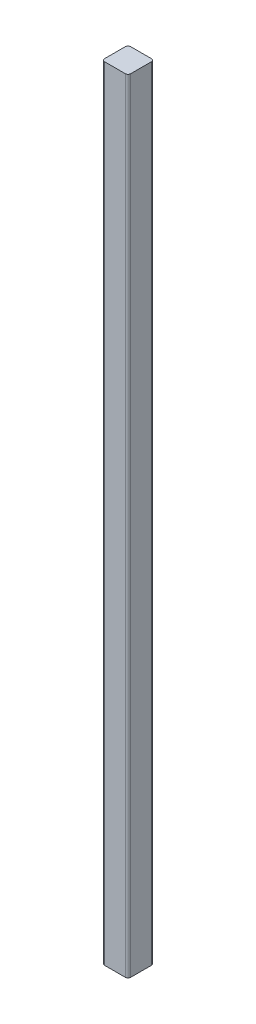
ISO-10303-21;
HEADER;
FILE_DESCRIPTION(('STEP AP214'),'2;1');
FILE_NAME('part.step','',(''),(''),'','','');
FILE_SCHEMA(('AUTOMOTIVE_DESIGN { 1 0 10303 214 1 1 1 1 }'));
ENDSEC;
DATA;
#1=APPLICATION_CONTEXT('core data for automotive mechanical design processes');
#2=APPLICATION_PROTOCOL_DEFINITION('international standard','automotive_design',2000,#1);
#3=PRODUCT_CONTEXT('',#1,'mechanical');
#4=PRODUCT('Part','Part','',(#3));
#5=PRODUCT_RELATED_PRODUCT_CATEGORY('part','',(#4));
#6=PRODUCT_DEFINITION_FORMATION('','',#4);
#7=PRODUCT_DEFINITION_CONTEXT('part definition',#1,'design');
#8=PRODUCT_DEFINITION('design','',#6,#7);
#9=PRODUCT_DEFINITION_SHAPE('','',#8);
#10=(LENGTH_UNIT() NAMED_UNIT(*) SI_UNIT(.MILLI.,.METRE.));
#11=(NAMED_UNIT(*) PLANE_ANGLE_UNIT() SI_UNIT($,.RADIAN.));
#12=(NAMED_UNIT(*) SI_UNIT($,.STERADIAN.) SOLID_ANGLE_UNIT());
#13=UNCERTAINTY_MEASURE_WITH_UNIT(LENGTH_MEASURE(1.E-05),#10,'distance_accuracy_value','');
#14=(GEOMETRIC_REPRESENTATION_CONTEXT(3) GLOBAL_UNCERTAINTY_ASSIGNED_CONTEXT((#13)) GLOBAL_UNIT_ASSIGNED_CONTEXT((#10,
#11,#12)) REPRESENTATION_CONTEXT('',''));
#15=CARTESIAN_POINT('',(0.,0.,0.));
#16=DIRECTION('',(0.,0.,1.));
#17=DIRECTION('',(1.,0.,0.));
#18=AXIS2_PLACEMENT_3D('',#15,#16,#17);
#19=CARTESIAN_POINT('',(-15.0192265790983,889.999999999986,-672.009684447686));
#20=DIRECTION('',(-1.,0.,0.));
#21=DIRECTION('',(0.,0.,1.));
#22=AXIS2_PLACEMENT_3D('',#19,#20,#21);
#23=PLANE('',#22);
#24=DIRECTION('',(0.,-1.,0.));
#25=VECTOR('',#24,1.);
#26=CARTESIAN_POINT('',(-15.019226579096,889.999999999986,-699.009684447687));
#27=LINE('',#26,#25);
#28=CARTESIAN_POINT('',(-15.0192265791199,-10.0000000000127,-699.009684447686));
#29=VERTEX_POINT('',#28);
#30=CARTESIAN_POINT('',(-15.019226579097,889.999999999986,-699.009684447686));
#31=VERTEX_POINT('',#30);
#32=EDGE_CURVE('E91',#29,#31,#27,.F.);
#33=ORIENTED_EDGE('',*,*,#32,.F.);
#34=DIRECTION('',(0.,0.,1.));
#35=VECTOR('',#34,1.);
#36=CARTESIAN_POINT('',(-15.0192265791209,-10.0000000000128,-687.009684447685));
#37=LINE('',#36,#35);
#38=CARTESIAN_POINT('',(-15.0192265791209,-10.0000000000128,-675.00963378795));
#39=VERTEX_POINT('',#38);
#40=EDGE_CURVE('E89',#39,#29,#37,.F.);
#41=ORIENTED_EDGE('',*,*,#40,.F.);
#42=DIRECTION('',(0.,-1.,0.));
#43=VECTOR('',#42,1.);
#44=CARTESIAN_POINT('',(-15.019226579098,889.999999999986,-675.00963378795));
#45=LINE('',#44,#43);
#46=CARTESIAN_POINT('',(-15.019226579098,889.999999999986,-675.00963378795));
#47=VERTEX_POINT('',#46);
#48=EDGE_CURVE('E77',#47,#39,#45,.T.);
#49=ORIENTED_EDGE('',*,*,#48,.F.);
#50=DIRECTION('',(0.,0.,1.));
#51=VECTOR('',#50,1.);
#52=CARTESIAN_POINT('',(-15.019226579098,889.999999999986,-687.009684447685));
#53=LINE('',#52,#51);
#54=EDGE_CURVE('E108',#47,#31,#53,.F.);
#55=ORIENTED_EDGE('',*,*,#54,.T.);
#56=EDGE_LOOP('',(#33,#41,#49,#55));
#57=FACE_BOUND('',#56,.T.);
#58=ADVANCED_FACE('F17',(#57),#23,.T.);
#59=CARTESIAN_POINT('',(-12.019226579096,889.999999999986,-699.009684447686));
#60=DIRECTION('',(0.,-1.,0.));
#61=DIRECTION('',(1.,0.,0.));
#62=AXIS2_PLACEMENT_3D('',#59,#60,#61);
#63=CYLINDRICAL_SURFACE('',#62,3.);
#64=CARTESIAN_POINT('',(-12.019226579096,889.999999999986,-699.009684447686));
#65=DIRECTION('',(0.,-1.,0.));
#66=DIRECTION('',(1.,0.,0.));
#67=AXIS2_PLACEMENT_3D('',#64,#65,#66);
#68=CIRCLE('',#67,3.);
#69=CARTESIAN_POINT('',(-12.0192265791073,889.999999999986,-702.009684447686));
#70=VERTEX_POINT('',#69);
#71=EDGE_CURVE('E121',#31,#70,#68,.T.);
#72=ORIENTED_EDGE('',*,*,#71,.T.);
#73=DIRECTION('',(0.,1.,0.));
#74=VECTOR('',#73,1.);
#75=CARTESIAN_POINT('',(-12.0192265791186,889.999999999986,-702.009684447686));
#76=LINE('',#75,#74);
#77=CARTESIAN_POINT('',(-12.0192265791187,-10.0000000000128,-702.009684447686));
#78=VERTEX_POINT('',#77);
#79=EDGE_CURVE('E110',#78,#70,#76,.T.);
#80=ORIENTED_EDGE('',*,*,#79,.F.);
#81=CARTESIAN_POINT('',(-12.0192265791189,-10.0000000000128,-699.009684447686));
#82=DIRECTION('',(0.,-1.,0.));
#83=DIRECTION('',(1.,0.,0.));
#84=AXIS2_PLACEMENT_3D('',#81,#82,#83);
#85=CIRCLE('',#84,3.);
#86=EDGE_CURVE('E95',#29,#78,#85,.T.);
#87=ORIENTED_EDGE('',*,*,#86,.F.);
#88=ORIENTED_EDGE('',*,*,#32,.T.);
#89=EDGE_LOOP('',(#72,#80,#87,#88));
#90=FACE_BOUND('',#89,.T.);
#91=ADVANCED_FACE('F224',(#90),#63,.T.);
#92=CARTESIAN_POINT('',(-15.0192265790958,889.999999999986,-702.009684447686));
#93=DIRECTION('',(0.,0.,-1.));
#94=DIRECTION('',(-1.,0.,0.));
#95=AXIS2_PLACEMENT_3D('',#92,#93,#94);
#96=PLANE('',#95);
#97=DIRECTION('',(0.,-1.,0.));
#98=VECTOR('',#97,1.);
#99=CARTESIAN_POINT('',(11.9807734209043,889.999999999986,-702.009684447684));
#100=LINE('',#99,#98);
#101=CARTESIAN_POINT('',(11.9807734208813,-10.0000000000134,-702.009684447685));
#102=VERTEX_POINT('',#101);
#103=CARTESIAN_POINT('',(11.9807734209041,889.999999999986,-702.009684447685));
#104=VERTEX_POINT('',#103);
#105=EDGE_CURVE('E106',#102,#104,#100,.F.);
#106=ORIENTED_EDGE('',*,*,#105,.F.);
#107=DIRECTION('',(1.,0.,0.));
#108=VECTOR('',#107,1.);
#109=CARTESIAN_POINT('',(-0.0192265791198715,-10.0000000000132,-702.009684447686));
#110=LINE('',#109,#108);
#111=EDGE_CURVE('E126',#78,#102,#110,.T.);
#112=ORIENTED_EDGE('',*,*,#111,.F.);
#113=ORIENTED_EDGE('',*,*,#79,.T.);
#114=DIRECTION('',(1.,0.,0.));
#115=VECTOR('',#114,1.);
#116=CARTESIAN_POINT('',(-0.01922657909702,889.999999999986,-702.009684447686));
#117=LINE('',#116,#115);
#118=EDGE_CURVE('E120',#70,#104,#117,.T.);
#119=ORIENTED_EDGE('',*,*,#118,.T.);
#120=EDGE_LOOP('',(#106,#112,#113,#119));
#121=FACE_BOUND('',#120,.T.);
#122=ADVANCED_FACE('F215',(#121),#96,.T.);
#123=CARTESIAN_POINT('',(14.9807734209017,889.999999999986,-672.009633787947));
#124=DIRECTION('',(0.,0.,1.));
#125=DIRECTION('',(1.,0.,0.));
#126=AXIS2_PLACEMENT_3D('',#123,#124,#125);
#127=PLANE('',#126);
#128=DIRECTION('',(0.,1.,0.));
#129=VECTOR('',#128,1.);
#130=CARTESIAN_POINT('',(11.9807734209017,889.999999999986,-672.009633787948));
#131=LINE('',#130,#129);
#132=CARTESIAN_POINT('',(11.9807734209019,889.999999999986,-672.009633787948));
#133=VERTEX_POINT('',#132);
#134=CARTESIAN_POINT('',(11.980773420879,-10.0000000000135,-672.009633787948));
#135=VERTEX_POINT('',#134);
#136=EDGE_CURVE('E86',#133,#135,#131,.F.);
#137=ORIENTED_EDGE('',*,*,#136,.F.);
#138=DIRECTION('',(1.,0.,0.));
#139=VECTOR('',#138,1.);
#140=CARTESIAN_POINT('',(-0.01922657909702,889.999999999986,-672.009633787948));
#141=LINE('',#140,#139);
#142=CARTESIAN_POINT('',(-12.0192265790981,889.999999999986,-672.009633787949));
#143=VERTEX_POINT('',#142);
#144=EDGE_CURVE('E116',#133,#143,#141,.F.);
#145=ORIENTED_EDGE('',*,*,#144,.T.);
#146=DIRECTION('',(0.,-1.,0.));
#147=VECTOR('',#146,1.);
#148=CARTESIAN_POINT('',(-12.0192265790982,889.999999999986,-672.00963378795));
#149=LINE('',#148,#147);
#150=CARTESIAN_POINT('',(-12.019226579121,-10.0000000000129,-672.009633787949));
#151=VERTEX_POINT('',#150);
#152=EDGE_CURVE('E71',#151,#143,#149,.F.);
#153=ORIENTED_EDGE('',*,*,#152,.F.);
#154=DIRECTION('',(1.,0.,0.));
#155=VECTOR('',#154,1.);
#156=CARTESIAN_POINT('',(-0.0192265791198715,-10.0000000000132,-672.009633787948));
#157=LINE('',#156,#155);
#158=EDGE_CURVE('E99',#135,#151,#157,.F.);
#159=ORIENTED_EDGE('',*,*,#158,.F.);
#160=EDGE_LOOP('',(#137,#145,#153,#159));
#161=FACE_BOUND('',#160,.T.);
#162=ADVANCED_FACE('F206',(#161),#127,.T.);
#163=CARTESIAN_POINT('',(-12.019226579098,889.999999999986,-675.00963378795));
#164=DIRECTION('',(0.,-1.,0.));
#165=DIRECTION('',(1.,0.,0.));
#166=AXIS2_PLACEMENT_3D('',#163,#164,#165);
#167=CYLINDRICAL_SURFACE('',#166,3.);
#168=CARTESIAN_POINT('',(-12.019226579098,889.999999999986,-675.00963378795));
#169=DIRECTION('',(0.,-1.,0.));
#170=DIRECTION('',(1.,0.,0.));
#171=AXIS2_PLACEMENT_3D('',#168,#169,#170);
#172=CIRCLE('',#171,3.);
#173=EDGE_CURVE('E83',#143,#47,#172,.T.);
#174=ORIENTED_EDGE('',*,*,#173,.T.);
#175=ORIENTED_EDGE('',*,*,#48,.T.);
#176=CARTESIAN_POINT('',(-12.0192265791209,-10.0000000000129,-675.00963378795));
#177=DIRECTION('',(0.,-1.,0.));
#178=DIRECTION('',(1.,0.,0.));
#179=AXIS2_PLACEMENT_3D('',#176,#177,#178);
#180=CIRCLE('',#179,3.);
#181=EDGE_CURVE('E20',#151,#39,#180,.T.);
#182=ORIENTED_EDGE('',*,*,#181,.F.);
#183=ORIENTED_EDGE('',*,*,#152,.T.);
#184=EDGE_LOOP('',(#174,#175,#182,#183));
#185=FACE_BOUND('',#184,.T.);
#186=ADVANCED_FACE('F79',(#185),#167,.T.);
#187=CARTESIAN_POINT('',(11.980773420902,889.999999999986,-675.009633787948));
#188=DIRECTION('',(0.,1.,0.));
#189=DIRECTION('',(-1.,0.,0.));
#190=AXIS2_PLACEMENT_3D('',#187,#188,#189);
#191=CYLINDRICAL_SURFACE('',#190,3.);
#192=CARTESIAN_POINT('',(11.9807734208791,-10.0000000000136,-675.009633787948));
#193=DIRECTION('',(0.,1.,0.));
#194=DIRECTION('',(-1.,0.,0.));
#195=AXIS2_PLACEMENT_3D('',#192,#193,#194);
#196=CIRCLE('',#195,3.);
#197=CARTESIAN_POINT('',(14.9807734208791,-10.0000000000136,-675.009633787947));
#198=VERTEX_POINT('',#197);
#199=EDGE_CURVE('E125',#198,#135,#196,.F.);
#200=ORIENTED_EDGE('',*,*,#199,.F.);
#201=DIRECTION('',(0.,1.,0.));
#202=VECTOR('',#201,1.);
#203=CARTESIAN_POINT('',(14.980773420902,889.999999999986,-675.009633787947));
#204=LINE('',#203,#202);
#205=CARTESIAN_POINT('',(14.980773420902,889.999999999986,-675.009633787947));
#206=VERTEX_POINT('',#205);
#207=EDGE_CURVE('E115',#206,#198,#204,.F.);
#208=ORIENTED_EDGE('',*,*,#207,.F.);
#209=CARTESIAN_POINT('',(11.980773420902,889.999999999986,-675.009633787948));
#210=DIRECTION('',(0.,1.,0.));
#211=DIRECTION('',(-1.,0.,0.));
#212=AXIS2_PLACEMENT_3D('',#209,#210,#211);
#213=CIRCLE('',#212,3.);
#214=EDGE_CURVE('E117',#206,#133,#213,.F.);
#215=ORIENTED_EDGE('',*,*,#214,.T.);
#216=ORIENTED_EDGE('',*,*,#136,.T.);
#217=EDGE_LOOP('',(#200,#208,#215,#216));
#218=FACE_BOUND('',#217,.T.);
#219=ADVANCED_FACE('F164',(#218),#191,.T.);
#220=CARTESIAN_POINT('',(-0.0192265791198715,-10.0000000000132,-687.009684447685));
#221=DIRECTION('',(0.,-1.,0.));
#222=DIRECTION('',(1.,0.,0.));
#223=AXIS2_PLACEMENT_3D('',#220,#221,#222);
#224=PLANE('',#223);
#225=ORIENTED_EDGE('',*,*,#199,.T.);
#226=ORIENTED_EDGE('',*,*,#158,.T.);
#227=ORIENTED_EDGE('',*,*,#181,.T.);
#228=ORIENTED_EDGE('',*,*,#40,.T.);
#229=ORIENTED_EDGE('',*,*,#86,.T.);
#230=ORIENTED_EDGE('',*,*,#111,.T.);
#231=CARTESIAN_POINT('',(11.9807734208811,-10.0000000000134,-699.009684447684));
#232=DIRECTION('',(0.,-1.,0.));
#233=DIRECTION('',(1.,0.,0.));
#234=AXIS2_PLACEMENT_3D('',#231,#232,#233);
#235=CIRCLE('',#234,3.);
#236=CARTESIAN_POINT('',(14.9807734208811,-10.0000000000135,-699.009684447684));
#237=VERTEX_POINT('',#236);
#238=EDGE_CURVE('E109',#237,#102,#235,.F.);
#239=ORIENTED_EDGE('',*,*,#238,.F.);
#240=DIRECTION('',(0.,0.,-1.));
#241=VECTOR('',#240,1.);
#242=CARTESIAN_POINT('',(14.9807734208814,-10.0000000000136,-702.009684447684));
#243=LINE('',#242,#241);
#244=EDGE_CURVE('E147',#198,#237,#243,.T.);
#245=ORIENTED_EDGE('',*,*,#244,.F.);
#246=EDGE_LOOP('',(#225,#226,#227,#228,#229,#230,#239,#245));
#247=FACE_BOUND('',#246,.T.);
#248=ADVANCED_FACE('F98',(#247),#224,.T.);
#249=CARTESIAN_POINT('',(11.980773420904,889.999999999986,-699.009684447684));
#250=DIRECTION('',(0.,-1.,0.));
#251=DIRECTION('',(1.,0.,0.));
#252=AXIS2_PLACEMENT_3D('',#249,#250,#251);
#253=CYLINDRICAL_SURFACE('',#252,3.);
#254=CARTESIAN_POINT('',(11.980773420904,889.999999999986,-699.009684447684));
#255=DIRECTION('',(0.,-1.,0.));
#256=DIRECTION('',(1.,0.,0.));
#257=AXIS2_PLACEMENT_3D('',#254,#255,#256);
#258=CIRCLE('',#257,3.);
#259=CARTESIAN_POINT('',(14.980773420904,889.999999999986,-699.009684447684));
#260=VERTEX_POINT('',#259);
#261=EDGE_CURVE('E35',#104,#260,#258,.T.);
#262=ORIENTED_EDGE('',*,*,#261,.T.);
#263=DIRECTION('',(0.,1.,0.));
#264=VECTOR('',#263,1.);
#265=CARTESIAN_POINT('',(14.980773420904,889.999999999986,-699.009684447684));
#266=LINE('',#265,#264);
#267=EDGE_CURVE('E26',#237,#260,#266,.T.);
#268=ORIENTED_EDGE('',*,*,#267,.F.);
#269=ORIENTED_EDGE('',*,*,#238,.T.);
#270=ORIENTED_EDGE('',*,*,#105,.T.);
#271=EDGE_LOOP('',(#262,#268,#269,#270));
#272=FACE_BOUND('',#271,.T.);
#273=ADVANCED_FACE('F155',(#272),#253,.T.);
#274=CARTESIAN_POINT('',(-0.01922657909702,889.999999999986,-687.009684447685));
#275=DIRECTION('',(0.,-1.,0.));
#276=DIRECTION('',(1.,0.,0.));
#277=AXIS2_PLACEMENT_3D('',#274,#275,#276);
#278=PLANE('',#277);
#279=ORIENTED_EDGE('',*,*,#144,.F.);
#280=ORIENTED_EDGE('',*,*,#214,.F.);
#281=DIRECTION('',(0.,0.,-1.));
#282=VECTOR('',#281,1.);
#283=CARTESIAN_POINT('',(14.9807734209042,889.999999999986,-702.009684447684));
#284=LINE('',#283,#282);
#285=EDGE_CURVE('E11',#260,#206,#284,.F.);
#286=ORIENTED_EDGE('',*,*,#285,.F.);
#287=ORIENTED_EDGE('',*,*,#261,.F.);
#288=ORIENTED_EDGE('',*,*,#118,.F.);
#289=ORIENTED_EDGE('',*,*,#71,.F.);
#290=ORIENTED_EDGE('',*,*,#54,.F.);
#291=ORIENTED_EDGE('',*,*,#173,.F.);
#292=EDGE_LOOP('',(#279,#280,#286,#287,#288,#289,#290,#291));
#293=FACE_BOUND('',#292,.T.);
#294=ADVANCED_FACE('F137',(#293),#278,.F.);
#295=CARTESIAN_POINT('',(14.9807734209042,889.999999999986,-702.009684447684));
#296=DIRECTION('',(1.,0.,0.));
#297=DIRECTION('',(0.,0.,-1.));
#298=AXIS2_PLACEMENT_3D('',#295,#296,#297);
#299=PLANE('',#298);
#300=ORIENTED_EDGE('',*,*,#267,.T.);
#301=ORIENTED_EDGE('',*,*,#285,.T.);
#302=ORIENTED_EDGE('',*,*,#207,.T.);
#303=ORIENTED_EDGE('',*,*,#244,.T.);
#304=EDGE_LOOP('',(#300,#301,#302,#303));
#305=FACE_BOUND('',#304,.T.);
#306=ADVANCED_FACE('F153',(#305),#299,.T.);
#307=CLOSED_SHELL('',(#58,#91,#122,#162,#186,#219,#248,#273,#294,#306));
#308=MANIFOLD_SOLID_BREP('B1',#307);
#309=ADVANCED_BREP_SHAPE_REPRESENTATION('',(#18,#308),#14);
#310=SHAPE_DEFINITION_REPRESENTATION(#9,#309);
ENDSEC;
END-ISO-10303-21;
